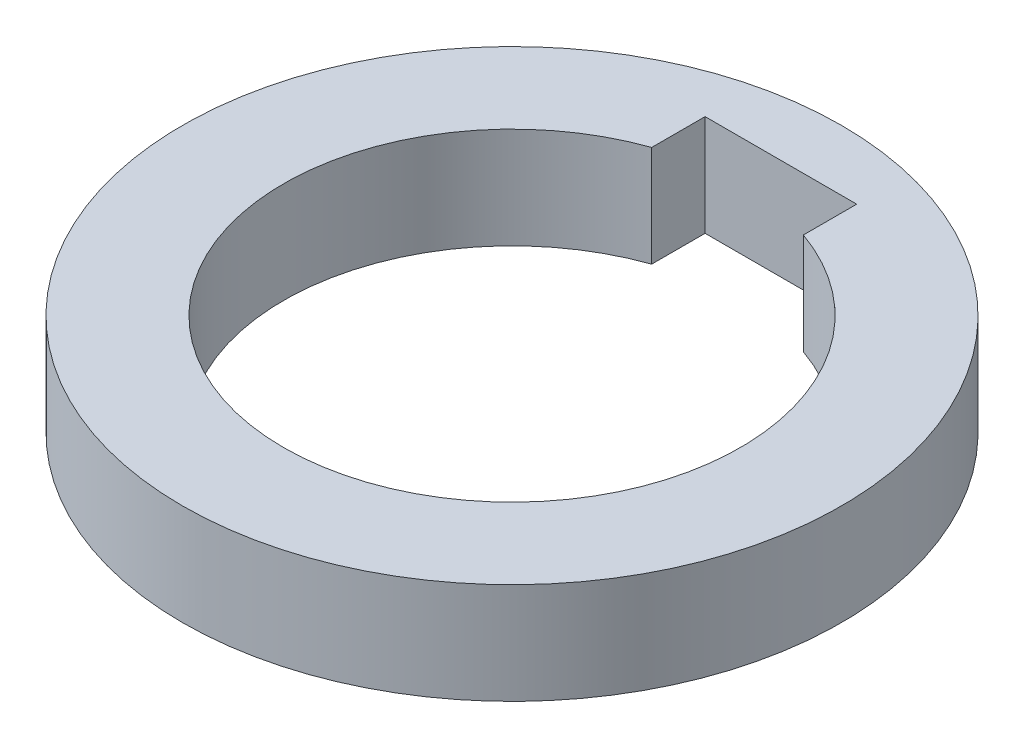
ISO-10303-21;
HEADER;
FILE_DESCRIPTION(('STEP AP214'),'2;1');
FILE_NAME('part.step','',(''),(''),'','','');
FILE_SCHEMA(('AUTOMOTIVE_DESIGN { 1 0 10303 214 1 1 1 1 }'));
ENDSEC;
DATA;
#1=APPLICATION_CONTEXT('core data for automotive mechanical design processes');
#2=APPLICATION_PROTOCOL_DEFINITION('international standard','automotive_design',2000,#1);
#3=PRODUCT_CONTEXT('',#1,'mechanical');
#4=PRODUCT('Part','Part','',(#3));
#5=PRODUCT_RELATED_PRODUCT_CATEGORY('part','',(#4));
#6=PRODUCT_DEFINITION_FORMATION('','',#4);
#7=PRODUCT_DEFINITION_CONTEXT('part definition',#1,'design');
#8=PRODUCT_DEFINITION('design','',#6,#7);
#9=PRODUCT_DEFINITION_SHAPE('','',#8);
#10=(LENGTH_UNIT() NAMED_UNIT(*) SI_UNIT(.MILLI.,.METRE.));
#11=(NAMED_UNIT(*) PLANE_ANGLE_UNIT() SI_UNIT($,.RADIAN.));
#12=(NAMED_UNIT(*) SI_UNIT($,.STERADIAN.) SOLID_ANGLE_UNIT());
#13=UNCERTAINTY_MEASURE_WITH_UNIT(LENGTH_MEASURE(1.E-05),#10,'distance_accuracy_value','');
#14=(GEOMETRIC_REPRESENTATION_CONTEXT(3) GLOBAL_UNCERTAINTY_ASSIGNED_CONTEXT((#13)) GLOBAL_UNIT_ASSIGNED_CONTEXT((#10,
#11,#12)) REPRESENTATION_CONTEXT('',''));
#15=CARTESIAN_POINT('',(0.,0.,0.));
#16=DIRECTION('',(0.,0.,1.));
#17=DIRECTION('',(1.,0.,0.));
#18=AXIS2_PLACEMENT_3D('',#15,#16,#17);
#19=CARTESIAN_POINT('',(0.,10.,0.));
#20=DIRECTION('',(0.,1.,0.));
#21=DIRECTION('',(0.,0.,1.));
#22=AXIS2_PLACEMENT_3D('',#19,#20,#21);
#23=PLANE('',#22);
#24=CARTESIAN_POINT('',(0.,10.,0.));
#25=DIRECTION('',(0.,1.,0.));
#26=DIRECTION('',(0.,0.,1.));
#27=AXIS2_PLACEMENT_3D('',#24,#25,#26);
#28=CIRCLE('',#27,32.6);
#29=CARTESIAN_POINT('',(0.,10.,32.6));
#30=VERTEX_POINT('',#29);
#31=EDGE_CURVE('E11',#30,#30,#28,.T.);
#32=ORIENTED_EDGE('',*,*,#31,.T.);
#33=EDGE_LOOP('',(#32));
#34=FACE_BOUND('',#33,.T.);
#35=DIRECTION('',(0.,0.,-1.));
#36=VECTOR('',#35,1.);
#37=CARTESIAN_POINT('',(7.5,10.,-26.6));
#38=LINE('',#37,#36);
#39=CARTESIAN_POINT('',(7.5,10.,-21.3192401365527));
#40=VERTEX_POINT('',#39);
#41=CARTESIAN_POINT('',(7.5,10.,-26.6));
#42=VERTEX_POINT('',#41);
#43=EDGE_CURVE('E83',#40,#42,#38,.T.);
#44=ORIENTED_EDGE('',*,*,#43,.F.);
#45=CARTESIAN_POINT('',(0.,10.,0.));
#46=DIRECTION('',(0.,1.,0.));
#47=DIRECTION('',(0.,0.,1.));
#48=AXIS2_PLACEMENT_3D('',#45,#46,#47);
#49=CIRCLE('',#48,22.6);
#50=CARTESIAN_POINT('',(-7.5,10.,-21.3192401365527));
#51=VERTEX_POINT('',#50);
#52=EDGE_CURVE('E75',#51,#40,#49,.T.);
#53=ORIENTED_EDGE('',*,*,#52,.F.);
#54=DIRECTION('',(0.,0.,1.));
#55=VECTOR('',#54,1.);
#56=CARTESIAN_POINT('',(-7.5,10.,-26.6));
#57=LINE('',#56,#55);
#58=CARTESIAN_POINT('',(-7.5,10.,-26.6));
#59=VERTEX_POINT('',#58);
#60=EDGE_CURVE('E96',#59,#51,#57,.T.);
#61=ORIENTED_EDGE('',*,*,#60,.F.);
#62=DIRECTION('',(-1.,0.,0.));
#63=VECTOR('',#62,1.);
#64=CARTESIAN_POINT('',(-7.5,10.,-26.6));
#65=LINE('',#64,#63);
#66=EDGE_CURVE('E94',#42,#59,#65,.T.);
#67=ORIENTED_EDGE('',*,*,#66,.F.);
#68=EDGE_LOOP('',(#44,#53,#61,#67));
#69=FACE_BOUND('',#68,.T.);
#70=ADVANCED_FACE('F34',(#34,#69),#23,.T.);
#71=CARTESIAN_POINT('',(0.,0.,0.));
#72=DIRECTION('',(0.,1.,0.));
#73=DIRECTION('',(0.,0.,1.));
#74=AXIS2_PLACEMENT_3D('',#71,#72,#73);
#75=PLANE('',#74);
#76=CARTESIAN_POINT('',(0.,0.,0.));
#77=DIRECTION('',(0.,1.,0.));
#78=DIRECTION('',(0.,0.,1.));
#79=AXIS2_PLACEMENT_3D('',#76,#77,#78);
#80=CIRCLE('',#79,32.6);
#81=CARTESIAN_POINT('',(0.,0.,32.6));
#82=VERTEX_POINT('',#81);
#83=EDGE_CURVE('E38',#82,#82,#80,.T.);
#84=ORIENTED_EDGE('',*,*,#83,.F.);
#85=EDGE_LOOP('',(#84));
#86=FACE_BOUND('',#85,.T.);
#87=CARTESIAN_POINT('',(0.,0.,0.));
#88=DIRECTION('',(0.,1.,0.));
#89=DIRECTION('',(0.,0.,1.));
#90=AXIS2_PLACEMENT_3D('',#87,#88,#89);
#91=CIRCLE('',#90,22.6);
#92=CARTESIAN_POINT('',(-7.5,0.,-21.3192401365527));
#93=VERTEX_POINT('',#92);
#94=CARTESIAN_POINT('',(7.5,0.,-21.3192401365527));
#95=VERTEX_POINT('',#94);
#96=EDGE_CURVE('E57',#93,#95,#91,.T.);
#97=ORIENTED_EDGE('',*,*,#96,.T.);
#98=DIRECTION('',(0.,0.,-1.));
#99=VECTOR('',#98,1.);
#100=CARTESIAN_POINT('',(7.5,0.,-26.6));
#101=LINE('',#100,#99);
#102=CARTESIAN_POINT('',(7.5,0.,-26.6));
#103=VERTEX_POINT('',#102);
#104=EDGE_CURVE('E90',#95,#103,#101,.T.);
#105=ORIENTED_EDGE('',*,*,#104,.T.);
#106=DIRECTION('',(-1.,0.,0.));
#107=VECTOR('',#106,1.);
#108=CARTESIAN_POINT('',(-7.5,0.,-26.6));
#109=LINE('',#108,#107);
#110=CARTESIAN_POINT('',(-7.5,0.,-26.6));
#111=VERTEX_POINT('',#110);
#112=EDGE_CURVE('E102',#103,#111,#109,.T.);
#113=ORIENTED_EDGE('',*,*,#112,.T.);
#114=DIRECTION('',(0.,0.,1.));
#115=VECTOR('',#114,1.);
#116=CARTESIAN_POINT('',(-7.5,0.,-26.6));
#117=LINE('',#116,#115);
#118=EDGE_CURVE('E84',#111,#93,#117,.T.);
#119=ORIENTED_EDGE('',*,*,#118,.T.);
#120=EDGE_LOOP('',(#97,#105,#113,#119));
#121=FACE_BOUND('',#120,.T.);
#122=ADVANCED_FACE('F113',(#86,#121),#75,.F.);
#123=CARTESIAN_POINT('',(0.,10.,0.));
#124=DIRECTION('',(0.,-1.,0.));
#125=DIRECTION('',(0.,0.,-1.));
#126=AXIS2_PLACEMENT_3D('',#123,#124,#125);
#127=CYLINDRICAL_SURFACE('',#126,32.6);
#128=ORIENTED_EDGE('',*,*,#31,.F.);
#129=EDGE_LOOP('',(#128));
#130=FACE_BOUND('',#129,.T.);
#131=ORIENTED_EDGE('',*,*,#83,.T.);
#132=EDGE_LOOP('',(#131));
#133=FACE_BOUND('',#132,.T.);
#134=ADVANCED_FACE('F36',(#130,#133),#127,.T.);
#135=CARTESIAN_POINT('',(0.,10.,0.));
#136=DIRECTION('',(0.,-1.,0.));
#137=DIRECTION('',(0.,0.,-1.));
#138=AXIS2_PLACEMENT_3D('',#135,#136,#137);
#139=CYLINDRICAL_SURFACE('',#138,22.6);
#140=ORIENTED_EDGE('',*,*,#96,.F.);
#141=DIRECTION('',(0.,-1.,0.));
#142=VECTOR('',#141,1.);
#143=CARTESIAN_POINT('',(-7.5,10.,-21.3192401365527));
#144=LINE('',#143,#142);
#145=EDGE_CURVE('E79',#51,#93,#144,.T.);
#146=ORIENTED_EDGE('',*,*,#145,.F.);
#147=ORIENTED_EDGE('',*,*,#52,.T.);
#148=DIRECTION('',(0.,-1.,0.));
#149=VECTOR('',#148,1.);
#150=CARTESIAN_POINT('',(7.5,10.,-21.3192401365527));
#151=LINE('',#150,#149);
#152=EDGE_CURVE('E78',#40,#95,#151,.T.);
#153=ORIENTED_EDGE('',*,*,#152,.T.);
#154=EDGE_LOOP('',(#140,#146,#147,#153));
#155=FACE_BOUND('',#154,.T.);
#156=ADVANCED_FACE('F77',(#155),#139,.F.);
#157=CARTESIAN_POINT('',(7.5,10.,-26.6));
#158=DIRECTION('',(-1.,0.,0.));
#159=DIRECTION('',(0.,0.,1.));
#160=AXIS2_PLACEMENT_3D('',#157,#158,#159);
#161=PLANE('',#160);
#162=ORIENTED_EDGE('',*,*,#104,.F.);
#163=ORIENTED_EDGE('',*,*,#152,.F.);
#164=ORIENTED_EDGE('',*,*,#43,.T.);
#165=DIRECTION('',(0.,-1.,0.));
#166=VECTOR('',#165,1.);
#167=CARTESIAN_POINT('',(7.5,10.,-26.6));
#168=LINE('',#167,#166);
#169=EDGE_CURVE('E91',#42,#103,#168,.T.);
#170=ORIENTED_EDGE('',*,*,#169,.T.);
#171=EDGE_LOOP('',(#162,#163,#164,#170));
#172=FACE_BOUND('',#171,.T.);
#173=ADVANCED_FACE('F87',(#172),#161,.T.);
#174=CARTESIAN_POINT('',(-7.5,10.,-26.6));
#175=DIRECTION('',(0.,0.,1.));
#176=DIRECTION('',(1.,0.,0.));
#177=AXIS2_PLACEMENT_3D('',#174,#175,#176);
#178=PLANE('',#177);
#179=ORIENTED_EDGE('',*,*,#112,.F.);
#180=ORIENTED_EDGE('',*,*,#169,.F.);
#181=ORIENTED_EDGE('',*,*,#66,.T.);
#182=DIRECTION('',(0.,-1.,0.));
#183=VECTOR('',#182,1.);
#184=CARTESIAN_POINT('',(-7.5,10.,-26.6));
#185=LINE('',#184,#183);
#186=EDGE_CURVE('E49',#59,#111,#185,.T.);
#187=ORIENTED_EDGE('',*,*,#186,.T.);
#188=EDGE_LOOP('',(#179,#180,#181,#187));
#189=FACE_BOUND('',#188,.T.);
#190=ADVANCED_FACE('F111',(#189),#178,.T.);
#191=CARTESIAN_POINT('',(-7.5,10.,-26.6));
#192=DIRECTION('',(1.,0.,0.));
#193=DIRECTION('',(0.,0.,-1.));
#194=AXIS2_PLACEMENT_3D('',#191,#192,#193);
#195=PLANE('',#194);
#196=ORIENTED_EDGE('',*,*,#118,.F.);
#197=ORIENTED_EDGE('',*,*,#186,.F.);
#198=ORIENTED_EDGE('',*,*,#60,.T.);
#199=ORIENTED_EDGE('',*,*,#145,.T.);
#200=EDGE_LOOP('',(#196,#197,#198,#199));
#201=FACE_BOUND('',#200,.T.);
#202=ADVANCED_FACE('F114',(#201),#195,.T.);
#203=CLOSED_SHELL('',(#70,#122,#134,#156,#173,#190,#202));
#204=MANIFOLD_SOLID_BREP('B2',#203);
#205=ADVANCED_BREP_SHAPE_REPRESENTATION('',(#18,#204),#14);
#206=SHAPE_DEFINITION_REPRESENTATION(#9,#205);
ENDSEC;
END-ISO-10303-21;
